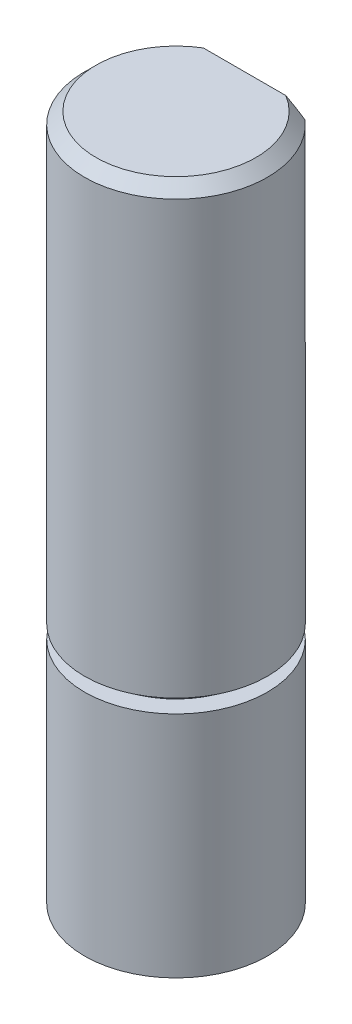
ISO-10303-21;
HEADER;
FILE_DESCRIPTION(('STEP AP214'),'2;1');
FILE_NAME('part.step','',(''),(''),'','','');
FILE_SCHEMA(('AUTOMOTIVE_DESIGN { 1 0 10303 214 1 1 1 1 }'));
ENDSEC;
DATA;
#1=APPLICATION_CONTEXT('core data for automotive mechanical design processes');
#2=APPLICATION_PROTOCOL_DEFINITION('international standard','automotive_design',2000,#1);
#3=PRODUCT_CONTEXT('',#1,'mechanical');
#4=PRODUCT('Part','Part','',(#3));
#5=PRODUCT_RELATED_PRODUCT_CATEGORY('part','',(#4));
#6=PRODUCT_DEFINITION_FORMATION('','',#4);
#7=PRODUCT_DEFINITION_CONTEXT('part definition',#1,'design');
#8=PRODUCT_DEFINITION('design','',#6,#7);
#9=PRODUCT_DEFINITION_SHAPE('','',#8);
#10=(LENGTH_UNIT() NAMED_UNIT(*) SI_UNIT(.MILLI.,.METRE.));
#11=(NAMED_UNIT(*) PLANE_ANGLE_UNIT() SI_UNIT($,.RADIAN.));
#12=(NAMED_UNIT(*) SI_UNIT($,.STERADIAN.) SOLID_ANGLE_UNIT());
#13=UNCERTAINTY_MEASURE_WITH_UNIT(LENGTH_MEASURE(1.E-05),#10,'distance_accuracy_value','');
#14=(GEOMETRIC_REPRESENTATION_CONTEXT(3) GLOBAL_UNCERTAINTY_ASSIGNED_CONTEXT((#13)) GLOBAL_UNIT_ASSIGNED_CONTEXT((#10,
#11,#12)) REPRESENTATION_CONTEXT('',''));
#15=CARTESIAN_POINT('',(0.,0.,0.));
#16=DIRECTION('',(0.,0.,1.));
#17=DIRECTION('',(1.,0.,0.));
#18=AXIS2_PLACEMENT_3D('',#15,#16,#17);
#19=CARTESIAN_POINT('',(0.,-10.,0.));
#20=DIRECTION('',(0.,1.,0.));
#21=DIRECTION('',(0.,0.,1.));
#22=AXIS2_PLACEMENT_3D('',#19,#20,#21);
#23=CYLINDRICAL_SURFACE('',#22,4.);
#24=CARTESIAN_POINT('',(0.,0.599999999999998,0.));
#25=DIRECTION('',(0.,1.,0.));
#26=DIRECTION('',(0.,0.,1.));
#27=AXIS2_PLACEMENT_3D('',#24,#25,#26);
#28=CIRCLE('',#27,4.);
#29=CARTESIAN_POINT('',(0.,0.599999999999998,4.));
#30=VERTEX_POINT('',#29);
#31=EDGE_CURVE('E37',#30,#30,#28,.F.);
#32=ORIENTED_EDGE('',*,*,#31,.F.);
#33=EDGE_LOOP('',(#32));
#34=FACE_BOUND('',#33,.T.);
#35=DIRECTION('',(0.,1.,0.));
#36=VECTOR('',#35,1.);
#37=CARTESIAN_POINT('',(2.64575131106459,8.,-3.));
#38=LINE('',#37,#36);
#39=CARTESIAN_POINT('',(2.64575131106459,8.,-3.));
#40=VERTEX_POINT('',#39);
#41=CARTESIAN_POINT('',(2.64575131106459,19.5,-3.));
#42=VERTEX_POINT('',#41);
#43=EDGE_CURVE('E76',#40,#42,#38,.T.);
#44=ORIENTED_EDGE('',*,*,#43,.T.);
#45=CARTESIAN_POINT('',(0.,19.5,0.));
#46=DIRECTION('',(0.,1.,0.));
#47=DIRECTION('',(0.,0.,1.));
#48=AXIS2_PLACEMENT_3D('',#45,#46,#47);
#49=CIRCLE('',#48,4.);
#50=CARTESIAN_POINT('',(-2.64575131106459,19.5,-3.));
#51=VERTEX_POINT('',#50);
#52=EDGE_CURVE('E80',#42,#51,#49,.F.);
#53=ORIENTED_EDGE('',*,*,#52,.T.);
#54=DIRECTION('',(0.,1.,0.));
#55=VECTOR('',#54,1.);
#56=CARTESIAN_POINT('',(-2.64575131106459,8.,-3.));
#57=LINE('',#56,#55);
#58=CARTESIAN_POINT('',(-2.64575131106459,8.,-3.));
#59=VERTEX_POINT('',#58);
#60=EDGE_CURVE('E74',#59,#51,#57,.T.);
#61=ORIENTED_EDGE('',*,*,#60,.F.);
#62=CARTESIAN_POINT('',(0.,8.,0.));
#63=DIRECTION('',(0.,1.,0.));
#64=DIRECTION('',(0.,0.,1.));
#65=AXIS2_PLACEMENT_3D('',#62,#63,#64);
#66=CIRCLE('',#65,4.);
#67=EDGE_CURVE('E66',#40,#59,#66,.T.);
#68=ORIENTED_EDGE('',*,*,#67,.F.);
#69=EDGE_LOOP('',(#44,#53,#61,#68));
#70=FACE_BOUND('',#69,.T.);
#71=ADVANCED_FACE('F32',(#34,#70),#23,.T.);
#72=CARTESIAN_POINT('',(0.,20.,0.));
#73=DIRECTION('',(0.,1.,0.));
#74=DIRECTION('',(0.,0.,1.));
#75=AXIS2_PLACEMENT_3D('',#72,#73,#74);
#76=PLANE('',#75);
#77=DIRECTION('',(1.,0.,0.));
#78=VECTOR('',#77,1.);
#79=CARTESIAN_POINT('',(-2.64575131106459,20.,-3.));
#80=LINE('',#79,#78);
#81=CARTESIAN_POINT('',(-1.80277563773199,20.,-3.));
#82=VERTEX_POINT('',#81);
#83=CARTESIAN_POINT('',(1.80277563773199,20.,-3.));
#84=VERTEX_POINT('',#83);
#85=EDGE_CURVE('E49',#82,#84,#80,.T.);
#86=ORIENTED_EDGE('',*,*,#85,.F.);
#87=CARTESIAN_POINT('',(0.,20.,0.));
#88=DIRECTION('',(0.,1.,0.));
#89=DIRECTION('',(0.,0.,1.));
#90=AXIS2_PLACEMENT_3D('',#87,#88,#89);
#91=CIRCLE('',#90,3.5);
#92=EDGE_CURVE('E88',#82,#84,#91,.T.);
#93=ORIENTED_EDGE('',*,*,#92,.T.);
#94=EDGE_LOOP('',(#86,#93));
#95=FACE_BOUND('',#94,.T.);
#96=ADVANCED_FACE('F102',(#95),#76,.T.);
#97=CARTESIAN_POINT('',(0.,20.,0.));
#98=DIRECTION('',(0.,-1.,0.));
#99=DIRECTION('',(0.,0.,-1.));
#100=AXIS2_PLACEMENT_3D('',#97,#98,#99);
#101=CONICAL_SURFACE('',#100,3.5,0.785398163397441);
#102=CARTESIAN_POINT('',(-5.83499505488498,16.938965989226,-3.));
#103=CARTESIAN_POINT('',(-5.66468696293555,17.0903757892782,-3.));
#104=CARTESIAN_POINT('',(-5.49373335194558,17.2410727937865,-3.));
#105=CARTESIAN_POINT('',(-5.15001939532075,17.5405200919112,-3.));
#106=CARTESIAN_POINT('',(-4.97725840019523,17.6892696392188,-3.));
#107=CARTESIAN_POINT('',(-4.62721157590965,17.986162252918,-3.));
#108=CARTESIAN_POINT('',(-4.44989613430195,18.1342705110441,-3.));
#109=CARTESIAN_POINT('',(-4.092347378892,18.4268634474971,-3.));
#110=CARTESIAN_POINT('',(-3.91211467799822,18.57134887112,-3.));
#111=CARTESIAN_POINT('',(-3.55645961437151,18.8484855787081,-3.));
#112=CARTESIAN_POINT('',(-3.38122119667173,18.9813720744677,-3.));
#113=CARTESIAN_POINT('',(-3.02586564459213,19.2407715989202,-3.));
#114=CARTESIAN_POINT('',(-2.84574568808317,19.3672808144583,-3.));
#115=CARTESIAN_POINT('',(-2.57103616471083,19.5496072378915,-3.));
#116=CARTESIAN_POINT('',(-2.4788592059619,19.6090558718568,-3.));
#117=CARTESIAN_POINT('',(-2.29264891488346,19.7249614937999,-3.));
#118=CARTESIAN_POINT('',(-2.19861581084785,19.7814188465777,-3.));
#119=CARTESIAN_POINT('',(-2.00849807495957,19.8905659215363,-3.));
#120=CARTESIAN_POINT('',(-1.9124155373908,19.9432592711028,-3.));
#121=CARTESIAN_POINT('',(-1.71784609767845,20.0439809627031,-3.));
#122=CARTESIAN_POINT('',(-1.6193598185815,20.0920104978553,-3.));
#123=CARTESIAN_POINT('',(-1.42683682628037,20.1790019774945,-3.));
#124=CARTESIAN_POINT('',(-1.33298336568436,20.2183662352781,-3.));
#125=CARTESIAN_POINT('',(-1.14287816274401,20.290879547616,-3.));
#126=CARTESIAN_POINT('',(-1.04662643537552,20.3240286409694,-3.));
#127=CARTESIAN_POINT('',(-0.852297204491023,20.3826486518219,-3.));
#128=CARTESIAN_POINT('',(-0.754231016369807,20.4081565506004,-3.));
#129=CARTESIAN_POINT('',(-0.556235100208591,20.4504005055917,-3.));
#130=CARTESIAN_POINT('',(-0.456306110190389,20.4671399623644,-3.));
#131=CARTESIAN_POINT('',(-0.253836760284143,20.4909810916827,-3.));
#132=CARTESIAN_POINT('',(-0.151279477555893,20.4979421404769,-3.));
#133=CARTESIAN_POINT('',(0.0540034437574867,20.5012693591197,-3.));
#134=CARTESIAN_POINT('',(0.156729071681949,20.4976361757773,-3.));
#135=CARTESIAN_POINT('',(0.361571241381389,20.4800191738942,-3.));
#136=CARTESIAN_POINT('',(0.463685160955773,20.4660054383055,-3.));
#137=CARTESIAN_POINT('',(0.666157326793159,20.4285425687719,-3.));
#138=CARTESIAN_POINT('',(0.766515087451494,20.4050908667978,-3.));
#139=CARTESIAN_POINT('',(1.00005180665005,20.3403413656696,-3.));
#140=CARTESIAN_POINT('',(1.13228749499848,20.2956653952456,-3.));
#141=CARTESIAN_POINT('',(1.39228431190691,20.1948443980072,-3.));
#142=CARTESIAN_POINT('',(1.52004259131288,20.1386922182714,-3.));
#143=CARTESIAN_POINT('',(1.77261496698481,20.017215977585,-3.));
#144=CARTESIAN_POINT('',(1.89738774367904,19.9518071340137,-3.));
#145=CARTESIAN_POINT('',(2.14321034752908,19.814491676355,-3.));
#146=CARTESIAN_POINT('',(2.26426131694084,19.7425870830994,-3.));
#147=CARTESIAN_POINT('',(2.54422316056008,19.5684288351179,-3.));
#148=CARTESIAN_POINT('',(2.70190655763035,19.4642131606477,-3.));
#149=CARTESIAN_POINT('',(3.01304239672184,19.2496151327713,-3.));
#150=CARTESIAN_POINT('',(3.16649349396237,19.1392308522974,-3.));
#151=CARTESIAN_POINT('',(3.4703228712838,18.9138517191536,-3.));
#152=CARTESIAN_POINT('',(3.62069604360685,18.7988500139063,-3.));
#153=CARTESIAN_POINT('',(3.9188603245849,18.5655436104449,-3.));
#154=CARTESIAN_POINT('',(4.06665128417604,18.4472387225647,-3.));
#155=CARTESIAN_POINT('',(4.3516336603564,18.2150876682171,-3.));
#156=CARTESIAN_POINT('',(4.48894094595218,18.1013833244623,-3.));
#157=CARTESIAN_POINT('',(4.76208709604533,17.8722156383541,-3.));
#158=CARTESIAN_POINT('',(4.89792589797848,17.756752221557,-3.));
#159=CARTESIAN_POINT('',(5.16787384553186,17.5248722727418,-3.));
#160=CARTESIAN_POINT('',(5.30198764827924,17.4084611525822,-3.));
#161=CARTESIAN_POINT('',(5.56920033722529,17.174505055193,-3.));
#162=CARTESIAN_POINT('',(5.70229932009186,17.056960188438,-3.));
#163=CARTESIAN_POINT('',(5.83499505488499,16.938965989226,-3.));
#164=B_SPLINE_CURVE_WITH_KNOTS('',3,(#102,#103,#104,#105,#106,#107,#108,#109,#110,#111,#112,
#113,#114,#115,#116,#117,#118,#119,#120,#121,#122,#123,#124,#125,#126,#127,#128,#129,#130,#131,
#132,#133,#134,#135,#136,#137,#138,#139,#140,#141,#142,#143,#144,#145,#146,#147,#148,#149,#150,
#151,#152,#153,#154,#155,#156,#157,#158,#159,#160,#161,#162,#163),.UNSPECIFIED.,.F.,.F.,(4,2,2,
2,2,2,2,2,2,2,2,2,2,2,2,2,2,2,2,2,2,2,2,2,2,2,2,2,2,2,4),(0.,0.683654507752663,1.36756375940587,
2.0606332178344,2.7535589071067,3.41324718742776,4.07332534564769,4.40233598103029,
4.73130639930385,5.05995538641393,5.3885200743044,5.69366382177044,5.99880566425846,
6.30244591525519,6.60596832173769,6.91381250668969,7.22163789724308,7.5303539180815,
7.83915399604654,8.25715240118375,8.67541213636582,9.09778590261384,9.52002871767134,
10.0868377591344,10.6538248720809,11.221687015145,11.7895818316996,12.3243890194947,
12.8592189034718,13.3919807283701,13.9246911539601),.UNSPECIFIED.);
#165=EDGE_CURVE('E11',#51,#82,#164,.T.);
#166=ORIENTED_EDGE('',*,*,#165,.F.);
#167=ORIENTED_EDGE('',*,*,#52,.F.);
#168=EDGE_CURVE('E42',#84,#42,#164,.T.);
#169=ORIENTED_EDGE('',*,*,#168,.F.);
#170=ORIENTED_EDGE('',*,*,#92,.F.);
#171=EDGE_LOOP('',(#166,#167,#169,#170));
#172=FACE_BOUND('',#171,.T.);
#173=ADVANCED_FACE('F34',(#172),#101,.T.);
#174=CARTESIAN_POINT('',(-2.64575131106459,8.,-3.));
#175=DIRECTION('',(0.,0.,1.));
#176=DIRECTION('',(1.,0.,0.));
#177=AXIS2_PLACEMENT_3D('',#174,#175,#176);
#178=PLANE('',#177);
#179=ORIENTED_EDGE('',*,*,#165,.T.);
#180=ORIENTED_EDGE('',*,*,#85,.T.);
#181=ORIENTED_EDGE('',*,*,#168,.T.);
#182=ORIENTED_EDGE('',*,*,#43,.F.);
#183=DIRECTION('',(1.,0.,0.));
#184=VECTOR('',#183,1.);
#185=CARTESIAN_POINT('',(-2.64575131106459,8.,-3.));
#186=LINE('',#185,#184);
#187=EDGE_CURVE('E69',#59,#40,#186,.T.);
#188=ORIENTED_EDGE('',*,*,#187,.F.);
#189=ORIENTED_EDGE('',*,*,#60,.T.);
#190=EDGE_LOOP('',(#179,#180,#181,#182,#188,#189));
#191=FACE_BOUND('',#190,.T.);
#192=ADVANCED_FACE('F73',(#191),#178,.F.);
#193=CARTESIAN_POINT('',(0.,8.,0.));
#194=DIRECTION('',(0.,1.,0.));
#195=DIRECTION('',(0.,0.,1.));
#196=AXIS2_PLACEMENT_3D('',#193,#194,#195);
#197=PLANE('',#196);
#198=ORIENTED_EDGE('',*,*,#67,.T.);
#199=ORIENTED_EDGE('',*,*,#187,.T.);
#200=EDGE_LOOP('',(#198,#199));
#201=FACE_BOUND('',#200,.T.);
#202=ADVANCED_FACE('F68',(#201),#197,.T.);
#203=CARTESIAN_POINT('',(0.,0.599999999999999,-4.90189227485523));
#204=DIRECTION('',(0.,1.,0.));
#205=DIRECTION('',(0.,0.,1.));
#206=AXIS2_PLACEMENT_3D('',#203,#204,#205);
#207=PLANE('',#206);
#208=ORIENTED_EDGE('',*,*,#31,.T.);
#209=EDGE_LOOP('',(#208));
#210=FACE_BOUND('',#209,.T.);
#211=CARTESIAN_POINT('',(0.,0.599999999999998,0.));
#212=DIRECTION('',(0.,-1.,0.));
#213=DIRECTION('',(0.,0.,-1.));
#214=AXIS2_PLACEMENT_3D('',#211,#212,#213);
#215=CIRCLE('',#214,3.2);
#216=CARTESIAN_POINT('',(0.,0.599999999999998,-3.2));
#217=VERTEX_POINT('',#216);
#218=EDGE_CURVE('E125',#217,#217,#215,.T.);
#219=ORIENTED_EDGE('',*,*,#218,.F.);
#220=EDGE_LOOP('',(#219));
#221=FACE_BOUND('',#220,.T.);
#222=ADVANCED_FACE('F139',(#210,#221),#207,.F.);
#223=CARTESIAN_POINT('',(0.,0.,0.));
#224=DIRECTION('',(0.,-1.,0.));
#225=DIRECTION('',(0.,0.,-1.));
#226=AXIS2_PLACEMENT_3D('',#223,#224,#225);
#227=CYLINDRICAL_SURFACE('',#226,3.2);
#228=CARTESIAN_POINT('',(0.,0.,0.));
#229=DIRECTION('',(0.,-1.,0.));
#230=DIRECTION('',(0.,0.,-1.));
#231=AXIS2_PLACEMENT_3D('',#228,#229,#230);
#232=CIRCLE('',#231,3.2);
#233=CARTESIAN_POINT('',(0.,0.,-3.2));
#234=VERTEX_POINT('',#233);
#235=EDGE_CURVE('E128',#234,#234,#232,.T.);
#236=ORIENTED_EDGE('',*,*,#235,.F.);
#237=EDGE_LOOP('',(#236));
#238=FACE_BOUND('',#237,.T.);
#239=ORIENTED_EDGE('',*,*,#218,.T.);
#240=EDGE_LOOP('',(#239));
#241=FACE_BOUND('',#240,.T.);
#242=ADVANCED_FACE('F137',(#238,#241),#227,.T.);
#243=CARTESIAN_POINT('',(0.,0.,-3.2));
#244=DIRECTION('',(0.,-1.,0.));
#245=DIRECTION('',(0.,0.,-1.));
#246=AXIS2_PLACEMENT_3D('',#243,#244,#245);
#247=PLANE('',#246);
#248=CARTESIAN_POINT('',(0.,0.,0.));
#249=DIRECTION('',(0.,-1.,0.));
#250=DIRECTION('',(0.,0.,-1.));
#251=AXIS2_PLACEMENT_3D('',#248,#249,#250);
#252=CIRCLE('',#251,4.);
#253=CARTESIAN_POINT('',(0.,0.,-4.));
#254=VERTEX_POINT('',#253);
#255=EDGE_CURVE('E96',#254,#254,#252,.F.);
#256=ORIENTED_EDGE('',*,*,#255,.T.);
#257=EDGE_LOOP('',(#256));
#258=FACE_BOUND('',#257,.T.);
#259=ORIENTED_EDGE('',*,*,#235,.T.);
#260=EDGE_LOOP('',(#259));
#261=FACE_BOUND('',#260,.T.);
#262=ADVANCED_FACE('F109',(#258,#261),#247,.F.);
#263=CARTESIAN_POINT('',(0.,-10.,0.));
#264=DIRECTION('',(0.,1.,0.));
#265=DIRECTION('',(0.,0.,1.));
#266=AXIS2_PLACEMENT_3D('',#263,#264,#265);
#267=PLANE('',#266);
#268=CARTESIAN_POINT('',(0.,-10.,0.));
#269=DIRECTION('',(0.,1.,0.));
#270=DIRECTION('',(0.,0.,1.));
#271=AXIS2_PLACEMENT_3D('',#268,#269,#270);
#272=CIRCLE('',#271,4.);
#273=CARTESIAN_POINT('',(0.,-10.,4.));
#274=VERTEX_POINT('',#273);
#275=EDGE_CURVE('E82',#274,#274,#272,.T.);
#276=ORIENTED_EDGE('',*,*,#275,.F.);
#277=EDGE_LOOP('',(#276));
#278=FACE_BOUND('',#277,.T.);
#279=ADVANCED_FACE('F106',(#278),#267,.F.);
#280=ORIENTED_EDGE('',*,*,#255,.F.);
#281=EDGE_LOOP('',(#280));
#282=FACE_BOUND('',#281,.T.);
#283=ORIENTED_EDGE('',*,*,#275,.T.);
#284=EDGE_LOOP('',(#283));
#285=FACE_BOUND('',#284,.T.);
#286=ADVANCED_FACE('F108',(#282,#285),#23,.T.);
#287=CLOSED_SHELL('',(#71,#96,#173,#192,#202,#222,#242,#262,#279,#286));
#288=MANIFOLD_SOLID_BREP('B2',#287);
#289=ADVANCED_BREP_SHAPE_REPRESENTATION('',(#18,#288),#14);
#290=SHAPE_DEFINITION_REPRESENTATION(#9,#289);
ENDSEC;
END-ISO-10303-21;
